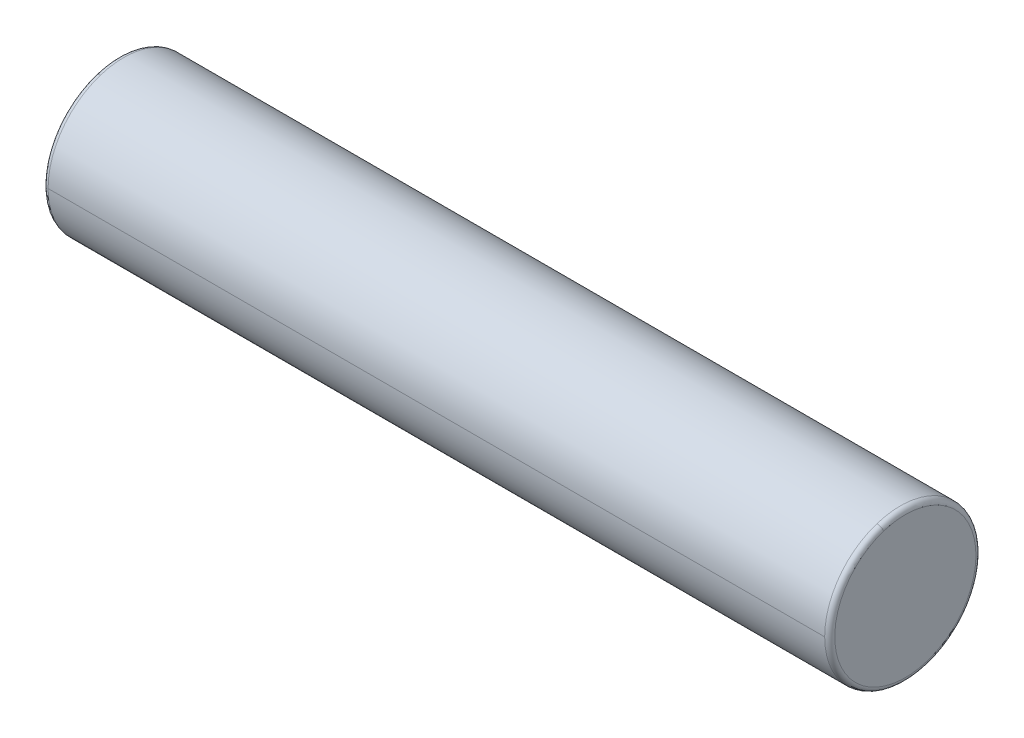
ISO-10303-21;
HEADER;
FILE_DESCRIPTION(('STEP AP214'),'2;1');
FILE_NAME('part.step','',(''),(''),'','','');
FILE_SCHEMA(('AUTOMOTIVE_DESIGN { 1 0 10303 214 1 1 1 1 }'));
ENDSEC;
DATA;
#1=APPLICATION_CONTEXT('core data for automotive mechanical design processes');
#2=APPLICATION_PROTOCOL_DEFINITION('international standard','automotive_design',2000,#1);
#3=PRODUCT_CONTEXT('',#1,'mechanical');
#4=PRODUCT('Part','Part','',(#3));
#5=PRODUCT_RELATED_PRODUCT_CATEGORY('part','',(#4));
#6=PRODUCT_DEFINITION_FORMATION('','',#4);
#7=PRODUCT_DEFINITION_CONTEXT('part definition',#1,'design');
#8=PRODUCT_DEFINITION('design','',#6,#7);
#9=PRODUCT_DEFINITION_SHAPE('','',#8);
#10=(LENGTH_UNIT() NAMED_UNIT(*) SI_UNIT(.MILLI.,.METRE.));
#11=(NAMED_UNIT(*) PLANE_ANGLE_UNIT() SI_UNIT($,.RADIAN.));
#12=(NAMED_UNIT(*) SI_UNIT($,.STERADIAN.) SOLID_ANGLE_UNIT());
#13=UNCERTAINTY_MEASURE_WITH_UNIT(LENGTH_MEASURE(1.E-05),#10,'distance_accuracy_value','');
#14=(GEOMETRIC_REPRESENTATION_CONTEXT(3) GLOBAL_UNCERTAINTY_ASSIGNED_CONTEXT((#13)) GLOBAL_UNIT_ASSIGNED_CONTEXT((#10,
#11,#12)) REPRESENTATION_CONTEXT('',''));
#15=CARTESIAN_POINT('',(0.,0.,0.));
#16=DIRECTION('',(0.,0.,1.));
#17=DIRECTION('',(1.,0.,0.));
#18=AXIS2_PLACEMENT_3D('',#15,#16,#17);
#19=CARTESIAN_POINT('',(2.1,3.75,0.));
#20=DIRECTION('',(1.,0.,0.));
#21=DIRECTION('',(0.,0.,-1.));
#22=AXIS2_PLACEMENT_3D('',#19,#20,#21);
#23=PLANE('',#22);
#24=CARTESIAN_POINT('',(2.1,4.41573956140652,0.216311896062434));
#25=CARTESIAN_POINT('',(2.1,4.41220039378035,0.227205120242794));
#26=CARTESIAN_POINT('',(2.1,4.40839342079428,0.238011307449353));
#27=CARTESIAN_POINT('',(2.1,4.40025403376515,0.259423954343163));
#28=CARTESIAN_POINT('',(2.1,4.39592161972208,0.270030414030415));
#29=CARTESIAN_POINT('',(2.1,4.38674152024174,0.291017952313907));
#30=CARTESIAN_POINT('',(2.1,4.38189383480447,0.301399030910147));
#31=CARTESIAN_POINT('',(2.1,4.37169494271154,0.321910825329425));
#32=CARTESIAN_POINT('',(2.1,4.36634373605587,0.332041541152462));
#33=CARTESIAN_POINT('',(2.1,4.35515067384588,0.352028196943182));
#34=CARTESIAN_POINT('',(2.1,4.34930881829157,0.361884136910865));
#35=CARTESIAN_POINT('',(2.1,4.3371485369722,0.381297499124348));
#36=CARTESIAN_POINT('',(2.1,4.33083011120713,0.390854921370148));
#37=CARTESIAN_POINT('',(2.1,4.31773190972843,0.409648222948401));
#38=CARTESIAN_POINT('',(2.1,4.3109521340148,0.418884102280853));
#39=CARTESIAN_POINT('',(2.1,4.29694756608198,0.437012068130574));
#40=CARTESIAN_POINT('',(2.1,4.28972277386278,0.445904154647843));
#41=CARTESIAN_POINT('',(2.1,4.27484557797712,0.463323113014291));
#42=CARTESIAN_POINT('',(2.1,4.26719317431064,0.47184998486347));
#43=CARTESIAN_POINT('',(2.1,4.25147919086763,0.48851797192267));
#44=CARTESIAN_POINT('',(2.1,4.2434176110911,0.496659087132692));
#45=CARTESIAN_POINT('',(2.1,4.22690469647266,0.512535948251258));
#46=CARTESIAN_POINT('',(2.1,4.21845336163076,0.520271694159802));
#47=CARTESIAN_POINT('',(2.1,4.20118129688937,0.535319180586672));
#48=CARTESIAN_POINT('',(2.1,4.19236056698989,0.542630921104998));
#49=CARTESIAN_POINT('',(2.1,4.17437096204376,0.556812782127896));
#50=CARTESIAN_POINT('',(2.1,4.16520208699712,0.563682902632468));
#51=CARTESIAN_POINT('',(2.1,4.14653828037989,0.576964972905863));
#52=CARTESIAN_POINT('',(2.1,4.13704334880931,0.583376922674686));
#53=CARTESIAN_POINT('',(2.1,4.11775030326599,0.595727204527956));
#54=CARTESIAN_POINT('',(2.1,4.10795218929324,0.601665536612403));
#55=CARTESIAN_POINT('',(2.1,4.08807638346038,0.613054277134795));
#56=CARTESIAN_POINT('',(2.1,4.07799869160026,0.618504685572741));
#57=CARTESIAN_POINT('',(2.1,4.05758800803502,0.628904448290805));
#58=CARTESIAN_POINT('',(2.1,4.04725501632991,0.633853802570923));
#59=CARTESIAN_POINT('',(2.1,4.02635862615678,0.643239533545359));
#60=CARTESIAN_POINT('',(2.1,4.01579522768877,0.647675910239676));
#61=CARTESIAN_POINT('',(2.1,3.99446347214198,0.656024998422473));
#62=CARTESIAN_POINT('',(2.1,3.9836951150632,0.659937709910952));
#63=CARTESIAN_POINT('',(2.1,3.96197938421031,0.667230041617384));
#64=CARTESIAN_POINT('',(2.1,3.95103201043618,0.670609661835336));
#65=CARTESIAN_POINT('',(2.1,3.92898461937487,0.676827669199589));
#66=CARTESIAN_POINT('',(2.1,3.91788460208769,0.679666056345889));
#67=CARTESIAN_POINT('',(2.1,3.89555866491416,0.68479475964359));
#68=CARTESIAN_POINT('',(2.1,3.88433274502782,0.68708507579499));
#69=CARTESIAN_POINT('',(2.1,3.86178204688025,0.691112119530673));
#70=CARTESIAN_POINT('',(2.1,3.85045726861902,0.692848847114956));
#71=CARTESIAN_POINT('',(2.1,3.82773613610444,0.695764529787534));
#72=CARTESIAN_POINT('',(2.1,3.81633978185109,0.69694348487583));
#73=CARTESIAN_POINT('',(2.1,3.79350295216788,0.698740782350362));
#74=CARTESIAN_POINT('',(2.1,3.78206247673801,0.699359124736598));
#75=CARTESIAN_POINT('',(2.1,3.75916496580913,0.700033707166043));
#76=CARTESIAN_POINT('',(2.1,3.74770793031013,0.700089947209252));
#77=CARTESIAN_POINT('',(2.1,3.724804900245,0.699640189465451));
#78=CARTESIAN_POINT('',(2.1,3.71335890567888,0.699134191678441));
#79=CARTESIAN_POINT('',(2.1,3.69050553188301,0.697561177267193));
#80=CARTESIAN_POINT('',(2.1,3.67909815265324,0.696494160642954));
#81=CARTESIAN_POINT('',(2.1,3.65634949090581,0.693801679093756));
#82=CARTESIAN_POINT('',(2.1,3.64500820838813,0.692176214168796));
#83=CARTESIAN_POINT('',(2.1,3.62241906220783,0.688370751905532));
#84=CARTESIAN_POINT('',(2.1,3.61117119854521,0.686190754567228));
#85=CARTESIAN_POINT('',(2.1,3.58879598716377,0.68128147928181));
#86=CARTESIAN_POINT('',(2.1,3.57766863944495,0.678552201334696));
#87=CARTESIAN_POINT('',(2.1,3.55556126670643,0.672550939901289));
#88=CARTESIAN_POINT('',(2.1,3.54458124168672,0.669278956414996));
#89=CARTESIAN_POINT('',(2.1,3.52279496618842,0.662200166398041));
#90=CARTESIAN_POINT('',(2.1,3.51198871570982,0.658393359867379));
#91=CARTESIAN_POINT('',(2.1,3.49057602249767,0.650254094692056));
#92=CARTESIAN_POINT('',(2.1,3.4799695797641,0.645921636047394));
#93=CARTESIAN_POINT('',(2.1,3.45898205389158,0.636741503916425));
#94=CARTESIAN_POINT('',(2.1,3.44860097075261,0.631893830430117));
#95=CARTESIAN_POINT('',(2.1,3.42808917300782,0.621694947085891));
#96=CARTESIAN_POINT('',(2.1,3.41795845840201,0.616343737227972));
#97=CARTESIAN_POINT('',(2.1,3.39797180350235,0.605150672673781));
#98=CARTESIAN_POINT('',(2.1,3.38811586320852,0.599308817977509));
#99=CARTESIAN_POINT('',(2.1,3.36870250075627,0.587148537286261));
#100=CARTESIAN_POINT('',(2.1,3.35914507859786,0.580830111291285));
#101=CARTESIAN_POINT('',(2.1,3.34035177708359,0.567731909644281));
#102=CARTESIAN_POINT('',(2.1,3.33111589772772,0.560952133992252));
#103=CARTESIAN_POINT('',(2.1,3.31298793186086,0.546947566104525));
#104=CARTESIAN_POINT('',(2.1,3.30409584534986,0.539722773868827));
#105=CARTESIAN_POINT('',(2.1,3.28667688698801,0.524845577971075));
#106=CARTESIAN_POINT('',(2.1,3.27815001513715,0.517193174309021));
#107=CARTESIAN_POINT('',(2.1,3.26148202807672,0.501479190869249));
#108=CARTESIAN_POINT('',(2.1,3.25334091286714,0.493417611091532));
#109=CARTESIAN_POINT('',(2.1,3.23746405174891,0.47690469647223));
#110=CARTESIAN_POINT('',(2.1,3.22972830584024,0.468453361630645));
#111=CARTESIAN_POINT('',(2.1,3.21468081941328,0.451181296889491));
#112=CARTESIAN_POINT('',(2.1,3.20736907889499,0.442360566989922));
#113=CARTESIAN_POINT('',(2.1,3.19318721787212,0.424370962043732));
#114=CARTESIAN_POINT('',(2.1,3.18631709736754,0.415202086997111));
#115=CARTESIAN_POINT('',(2.1,3.17303502709413,0.396538280379902));
#116=CARTESIAN_POINT('',(2.1,3.16662307732531,0.387043348809315));
#117=CARTESIAN_POINT('',(2.1,3.15427279547205,0.367750303265987));
#118=CARTESIAN_POINT('',(2.1,3.1483344633876,0.357952189293245));
#119=CARTESIAN_POINT('',(2.1,3.1369457228652,0.338076383460381));
#120=CARTESIAN_POINT('',(2.1,3.13149531442726,0.327998691600258));
#121=CARTESIAN_POINT('',(2.1,3.1210955517092,0.307588008035025));
#122=CARTESIAN_POINT('',(2.1,3.11614619742908,0.297255016329915));
#123=CARTESIAN_POINT('',(2.1,3.10676046645464,0.276358626156785));
#124=CARTESIAN_POINT('',(2.1,3.10232408976032,0.265795227688766));
#125=CARTESIAN_POINT('',(2.1,3.09397500157753,0.244463472141978));
#126=CARTESIAN_POINT('',(2.1,3.09006229008906,0.233695115063208));
#127=CARTESIAN_POINT('',(2.1,3.08276995838261,0.211979384210306));
#128=CARTESIAN_POINT('',(2.1,3.07939033816463,0.201032010436173));
#129=CARTESIAN_POINT('',(2.1,3.07317233080044,0.178984619374883));
#130=CARTESIAN_POINT('',(2.1,3.07033394365423,0.167884602087726));
#131=CARTESIAN_POINT('',(2.1,3.06520524035629,0.145558664914134));
#132=CARTESIAN_POINT('',(2.1,3.06291492420456,0.134332745027699));
#133=CARTESIAN_POINT('',(2.1,3.05888788046978,0.111782046880368));
#134=CARTESIAN_POINT('',(2.1,3.05715115288672,0.100457268619472));
#135=CARTESIAN_POINT('',(2.1,3.05423547021079,0.0777361361039879));
#136=CARTESIAN_POINT('',(2.1,3.05305651511793,0.0663397818494006));
#137=CARTESIAN_POINT('',(2.1,3.05125921765588,0.0435029521695724));
#138=CARTESIAN_POINT('',(2.1,3.05064087528668,0.0320624767443316));
#139=CARTESIAN_POINT('',(2.1,3.04996629281068,0.00916496580281616));
#140=CARTESIAN_POINT('',(2.1,3.04991005270386,-0.00229206971345843));
#141=CARTESIAN_POINT('',(2.1,3.05035981062143,-0.0251950997314124));
#142=CARTESIAN_POINT('',(2.1,3.05086580864581,-0.0366410942330917));
#143=CARTESIAN_POINT('',(2.1,3.05243882240855,-0.0594944682050133));
#144=CARTESIAN_POINT('',(2.1,3.05350583814691,-0.0709018476752554));
#145=CARTESIAN_POINT('',(2.1,3.05619832211637,-0.0936505087656896));
#146=CARTESIAN_POINT('',(2.1,3.05782379034747,-0.104991790385882));
#147=CARTESIAN_POINT('',(2.1,3.0616292435782,-0.127580939018153));
#148=CARTESIAN_POINT('',(2.1,3.06380922857782,-0.138828806030232));
#149=CARTESIAN_POINT('',(2.1,3.06871853757314,-0.161204008260792));
#150=CARTESIAN_POINT('',(2.1,3.07144786156883,-0.172331343479273));
#151=CARTESIAN_POINT('',(2.1,3.07744899719519,-0.194438750369344));
#152=CARTESIAN_POINT('',(2.1,3.08072080882586,-0.205418822040934));
#153=CARTESIAN_POINT('',(2.1,3.08426043859348,-0.216311896062432));
#154=B_SPLINE_CURVE_WITH_KNOTS('',3,(#24,#25,#26,#27,#28,#29,#30,#31,#32,#33,#34,#35,#36,#37,
#38,#39,#40,#41,#42,#43,#44,#45,#46,#47,#48,#49,#50,#51,#52,#53,#54,#55,#56,#57,#58,#59,#60,#61,
#62,#63,#64,#65,#66,#67,#68,#69,#70,#71,#72,#73,#74,#75,#76,#77,#78,#79,#80,#81,#82,#83,#84,#85,
#86,#87,#88,#89,#90,#91,#92,#93,#94,#95,#96,#97,#98,#99,#100,#101,#102,#103,#104,#105,#106,#107,
#108,#109,#110,#111,#112,#113,#114,#115,#116,#117,#118,#119,#120,#121,#122,#123,#124,#125,#126,
#127,#128,#129,#130,#131,#132,#133,#134,#135,#136,#137,#138,#139,#140,#141,#142,#143,#144,#145,
#146,#147,#148,#149,#150,#151,#152,#153),.UNSPECIFIED.,.F.,.F.,(4,2,2,2,2,2,2,2,2,2,2,2,2,2,2,2,
2,2,2,2,2,2,2,2,2,2,2,2,2,2,2,2,2,2,2,2,2,2,2,2,2,2,2,2,2,2,2,2,2,2,2,2,2,2,2,2,2,2,2,2,2,2,2,2,
4),(0.,0.0343577199320727,0.068715439864145,0.103073159796217,0.13743087972829,
0.171788599660363,0.206146319592435,0.240504039524508,0.27486175945658,0.309219479388653,
0.343577199320725,0.377934919252798,0.41229263918487,0.446650359116943,0.481008079049015,
0.515365798981088,0.549723518913161,0.584081238845233,0.618438958777306,0.652796678709378,
0.687154398641451,0.721512118573524,0.755869838505596,0.790227558437668,0.824585278369741,
0.858942998301814,0.893300718233886,0.927658438165958,0.962016158098031,0.996373878030104,
1.03073159796218,1.06508931789425,1.09944703782632,1.13380475775839,1.16816247769047,
1.20252019762254,1.23687791755461,1.27123563748668,1.30559335741876,1.33995107735083,
1.3743087972829,1.40866651721497,1.44302423714705,1.47738195707912,1.51173967701119,
1.54609739694326,1.58045511687534,1.61481283680741,1.64917055673948,1.68352827667155,
1.71788599660363,1.7522437165357,1.78660143646777,1.82095915639984,1.85531687633192,
1.88967459626399,1.92403231619606,1.95839003612813,1.99274775606021,2.02710547599228,
2.06146319592435,2.09582091585642,2.1301786357885,2.16453635572057,2.19889407565264),.UNSPECIFIED.);
#155=CARTESIAN_POINT('',(2.1,4.41573956140652,0.216311896062434));
#156=VERTEX_POINT('',#155);
#157=CARTESIAN_POINT('',(2.1,3.08426043859348,-0.216311896062434));
#158=VERTEX_POINT('',#157);
#159=EDGE_CURVE('E11',#156,#158,#154,.T.);
#160=ORIENTED_EDGE('',*,*,#159,.F.);
#161=CARTESIAN_POINT('',(2.1,3.08426043859348,-0.216311896062434));
#162=CARTESIAN_POINT('',(2.1,3.08779960621965,-0.227205120242794));
#163=CARTESIAN_POINT('',(2.1,3.09160657920571,-0.238011307449352));
#164=CARTESIAN_POINT('',(2.1,3.09974596623485,-0.259423954343163));
#165=CARTESIAN_POINT('',(2.1,3.10407838027792,-0.270030414030415));
#166=CARTESIAN_POINT('',(2.1,3.11325847975826,-0.291017952313907));
#167=CARTESIAN_POINT('',(2.1,3.11810616519553,-0.301399030910147));
#168=CARTESIAN_POINT('',(2.1,3.12830505728846,-0.321910825329424));
#169=CARTESIAN_POINT('',(2.1,3.13365626394413,-0.332041541152462));
#170=CARTESIAN_POINT('',(2.1,3.14484932615411,-0.352028196943182));
#171=CARTESIAN_POINT('',(2.1,3.15069118170843,-0.361884136910865));
#172=CARTESIAN_POINT('',(2.1,3.1628514630278,-0.381297499124348));
#173=CARTESIAN_POINT('',(2.1,3.16916988879287,-0.390854921370148));
#174=CARTESIAN_POINT('',(2.1,3.18226809027157,-0.409648222948401));
#175=CARTESIAN_POINT('',(2.1,3.1890478659852,-0.418884102280853));
#176=CARTESIAN_POINT('',(2.1,3.20305243391802,-0.437012068130574));
#177=CARTESIAN_POINT('',(2.1,3.21027722613721,-0.445904154647843));
#178=CARTESIAN_POINT('',(2.1,3.22515442202288,-0.463323113014291));
#179=CARTESIAN_POINT('',(2.1,3.23280682568936,-0.47184998486347));
#180=CARTESIAN_POINT('',(2.1,3.24852080913237,-0.48851797192267));
#181=CARTESIAN_POINT('',(2.1,3.2565823889089,-0.496659087132692));
#182=CARTESIAN_POINT('',(2.1,3.27309530352734,-0.512535948251258));
#183=CARTESIAN_POINT('',(2.1,3.28154663836924,-0.520271694159802));
#184=CARTESIAN_POINT('',(2.1,3.29881870311063,-0.535319180586672));
#185=CARTESIAN_POINT('',(2.1,3.30763943301011,-0.542630921104998));
#186=CARTESIAN_POINT('',(2.1,3.32562903795624,-0.556812782127896));
#187=CARTESIAN_POINT('',(2.1,3.33479791300288,-0.563682902632468));
#188=CARTESIAN_POINT('',(2.1,3.35346171962011,-0.576964972905863));
#189=CARTESIAN_POINT('',(2.1,3.36295665119069,-0.583376922674686));
#190=CARTESIAN_POINT('',(2.1,3.38224969673401,-0.595727204527956));
#191=CARTESIAN_POINT('',(2.1,3.39204781070675,-0.601665536612402));
#192=CARTESIAN_POINT('',(2.1,3.41192361653962,-0.613054277134795));
#193=CARTESIAN_POINT('',(2.1,3.42200130839974,-0.618504685572741));
#194=CARTESIAN_POINT('',(2.1,3.44241199196498,-0.628904448290805));
#195=CARTESIAN_POINT('',(2.1,3.45274498367009,-0.633853802570923));
#196=CARTESIAN_POINT('',(2.1,3.47364137384322,-0.643239533545359));
#197=CARTESIAN_POINT('',(2.1,3.48420477231123,-0.647675910239676));
#198=CARTESIAN_POINT('',(2.1,3.50553652785802,-0.656024998422473));
#199=CARTESIAN_POINT('',(2.1,3.51630488493679,-0.659937709910952));
#200=CARTESIAN_POINT('',(2.1,3.53802061578969,-0.667230041617384));
#201=CARTESIAN_POINT('',(2.1,3.54896798956382,-0.670609661835336));
#202=CARTESIAN_POINT('',(2.1,3.57101538062513,-0.676827669199589));
#203=CARTESIAN_POINT('',(2.1,3.58211539791231,-0.679666056345889));
#204=CARTESIAN_POINT('',(2.1,3.60444133508583,-0.68479475964359));
#205=CARTESIAN_POINT('',(2.1,3.61566725497218,-0.68708507579499));
#206=CARTESIAN_POINT('',(2.1,3.63821795311975,-0.691112119530673));
#207=CARTESIAN_POINT('',(2.1,3.64954273138098,-0.692848847114955));
#208=CARTESIAN_POINT('',(2.1,3.67226386389556,-0.695764529787534));
#209=CARTESIAN_POINT('',(2.1,3.68366021814891,-0.69694348487583));
#210=CARTESIAN_POINT('',(2.1,3.70649704783212,-0.698740782350362));
#211=CARTESIAN_POINT('',(2.1,3.71793752326199,-0.699359124736598));
#212=CARTESIAN_POINT('',(2.1,3.74083503419086,-0.700033707166044));
#213=CARTESIAN_POINT('',(2.1,3.75229206968987,-0.700089947209252));
#214=CARTESIAN_POINT('',(2.1,3.775195099755,-0.699640189465451));
#215=CARTESIAN_POINT('',(2.1,3.78664109432111,-0.699134191678441));
#216=CARTESIAN_POINT('',(2.1,3.80949446811699,-0.697561177267193));
#217=CARTESIAN_POINT('',(2.1,3.82090184734675,-0.696494160642955));
#218=CARTESIAN_POINT('',(2.1,3.84365050909419,-0.693801679093756));
#219=CARTESIAN_POINT('',(2.1,3.85499179161187,-0.692176214168796));
#220=CARTESIAN_POINT('',(2.1,3.87758093779217,-0.688370751905532));
#221=CARTESIAN_POINT('',(2.1,3.88882880145479,-0.686190754567228));
#222=CARTESIAN_POINT('',(2.1,3.91120401283623,-0.68128147928181));
#223=CARTESIAN_POINT('',(2.1,3.92233136055505,-0.678552201334696));
#224=CARTESIAN_POINT('',(2.1,3.94443873329357,-0.672550939901289));
#225=CARTESIAN_POINT('',(2.1,3.95541875831328,-0.669278956414996));
#226=CARTESIAN_POINT('',(2.1,3.97720503381158,-0.662200166398041));
#227=CARTESIAN_POINT('',(2.1,3.98801128429018,-0.658393359867379));
#228=CARTESIAN_POINT('',(2.1,4.00942397750233,-0.650254094692056));
#229=CARTESIAN_POINT('',(2.1,4.02003042023589,-0.645921636047394));
#230=CARTESIAN_POINT('',(2.1,4.04101794610842,-0.636741503916425));
#231=CARTESIAN_POINT('',(2.1,4.05139902924739,-0.631893830430118));
#232=CARTESIAN_POINT('',(2.1,4.07191082699218,-0.621694947085891));
#233=CARTESIAN_POINT('',(2.1,4.08204154159799,-0.616343737227972));
#234=CARTESIAN_POINT('',(2.1,4.10202819649765,-0.605150672673781));
#235=CARTESIAN_POINT('',(2.1,4.11188413679148,-0.59930881797751));
#236=CARTESIAN_POINT('',(2.1,4.13129749924373,-0.587148537286262));
#237=CARTESIAN_POINT('',(2.1,4.14085492140213,-0.580830111291286));
#238=CARTESIAN_POINT('',(2.1,4.15964822291641,-0.567731909644281));
#239=CARTESIAN_POINT('',(2.1,4.16888410227228,-0.560952133992253));
#240=CARTESIAN_POINT('',(2.1,4.18701206813914,-0.546947566104526));
#241=CARTESIAN_POINT('',(2.1,4.19590415465014,-0.539722773868827));
#242=CARTESIAN_POINT('',(2.1,4.21332311301199,-0.524845577971075));
#243=CARTESIAN_POINT('',(2.1,4.22184998486285,-0.517193174309022));
#244=CARTESIAN_POINT('',(2.1,4.23851797192328,-0.50147919086925));
#245=CARTESIAN_POINT('',(2.1,4.24665908713286,-0.493417611091533));
#246=CARTESIAN_POINT('',(2.1,4.26253594825109,-0.476904696472231));
#247=CARTESIAN_POINT('',(2.1,4.27027169415976,-0.468453361630646));
#248=CARTESIAN_POINT('',(2.1,4.28531918058671,-0.451181296889492));
#249=CARTESIAN_POINT('',(2.1,4.29263092110501,-0.442360566989923));
#250=CARTESIAN_POINT('',(2.1,4.30681278212788,-0.424370962043732));
#251=CARTESIAN_POINT('',(2.1,4.31368290263246,-0.415202086997111));
#252=CARTESIAN_POINT('',(2.1,4.32696497290586,-0.396538280379903));
#253=CARTESIAN_POINT('',(2.1,4.33337692267469,-0.387043348809316));
#254=CARTESIAN_POINT('',(2.1,4.34572720452795,-0.367750303265988));
#255=CARTESIAN_POINT('',(2.1,4.3516655366124,-0.357952189293246));
#256=CARTESIAN_POINT('',(2.1,4.36305427713479,-0.338076383460382));
#257=CARTESIAN_POINT('',(2.1,4.36850468557274,-0.327998691600259));
#258=CARTESIAN_POINT('',(2.1,4.3789044482908,-0.307588008035026));
#259=CARTESIAN_POINT('',(2.1,4.38385380257092,-0.297255016329915));
#260=CARTESIAN_POINT('',(2.1,4.39323953354536,-0.276358626156786));
#261=CARTESIAN_POINT('',(2.1,4.39767591023968,-0.265795227688767));
#262=CARTESIAN_POINT('',(2.1,4.40602499842247,-0.244463472141979));
#263=CARTESIAN_POINT('',(2.1,4.40993770991094,-0.233695115063209));
#264=CARTESIAN_POINT('',(2.1,4.41723004161739,-0.211979384210307));
#265=CARTESIAN_POINT('',(2.1,4.42060966183537,-0.201032010436174));
#266=CARTESIAN_POINT('',(2.1,4.42682766919956,-0.178984619374885));
#267=CARTESIAN_POINT('',(2.1,4.42966605634577,-0.167884602087727));
#268=CARTESIAN_POINT('',(2.1,4.43479475964371,-0.145558664914135));
#269=CARTESIAN_POINT('',(2.1,4.43708507579544,-0.134332745027701));
#270=CARTESIAN_POINT('',(2.1,4.44111211953022,-0.111782046880369));
#271=CARTESIAN_POINT('',(2.1,4.44284884711328,-0.100457268619473));
#272=CARTESIAN_POINT('',(2.1,4.4457645297892,-0.0777361361039889));
#273=CARTESIAN_POINT('',(2.1,4.44694348488207,-0.0663397818494017));
#274=CARTESIAN_POINT('',(2.1,4.44874078234412,-0.0435029521695737));
#275=CARTESIAN_POINT('',(2.1,4.44935912471332,-0.0320624767443329));
#276=CARTESIAN_POINT('',(2.1,4.45003370718932,-0.00916496580281751));
#277=CARTESIAN_POINT('',(2.1,4.45008994729614,0.00229206971345709));
#278=CARTESIAN_POINT('',(2.1,4.44964018937857,0.025195099731411));
#279=CARTESIAN_POINT('',(2.1,4.44913419135419,0.0366410942330904));
#280=CARTESIAN_POINT('',(2.1,4.44756117759145,0.0594944682050119));
#281=CARTESIAN_POINT('',(2.1,4.44649416185309,0.0709018476752541));
#282=CARTESIAN_POINT('',(2.1,4.44380167788363,0.0936505087656885));
#283=CARTESIAN_POINT('',(2.1,4.44217620965253,0.104991790385881));
#284=CARTESIAN_POINT('',(2.1,4.4383707564218,0.127580939018152));
#285=CARTESIAN_POINT('',(2.1,4.43619077142218,0.138828806030232));
#286=CARTESIAN_POINT('',(2.1,4.43128146242686,0.161204008260792));
#287=CARTESIAN_POINT('',(2.1,4.42855213843117,0.172331343479273));
#288=CARTESIAN_POINT('',(2.1,4.42255100280481,0.194438750369343));
#289=CARTESIAN_POINT('',(2.1,4.41927919117414,0.205418822040933));
#290=CARTESIAN_POINT('',(2.1,4.41573956140652,0.21631189606243));
#291=B_SPLINE_CURVE_WITH_KNOTS('',3,(#161,#162,#163,#164,#165,#166,#167,#168,#169,#170,#171,
#172,#173,#174,#175,#176,#177,#178,#179,#180,#181,#182,#183,#184,#185,#186,#187,#188,#189,#190,
#191,#192,#193,#194,#195,#196,#197,#198,#199,#200,#201,#202,#203,#204,#205,#206,#207,#208,#209,
#210,#211,#212,#213,#214,#215,#216,#217,#218,#219,#220,#221,#222,#223,#224,#225,#226,#227,#228,
#229,#230,#231,#232,#233,#234,#235,#236,#237,#238,#239,#240,#241,#242,#243,#244,#245,#246,#247,
#248,#249,#250,#251,#252,#253,#254,#255,#256,#257,#258,#259,#260,#261,#262,#263,#264,#265,#266,
#267,#268,#269,#270,#271,#272,#273,#274,#275,#276,#277,#278,#279,#280,#281,#282,#283,#284,#285,
#286,#287,#288,#289,#290),.UNSPECIFIED.,.F.,.F.,(4,2,2,2,2,2,2,2,2,2,2,2,2,2,2,2,2,2,2,2,2,2,2,
2,2,2,2,2,2,2,2,2,2,2,2,2,2,2,2,2,2,2,2,2,2,2,2,2,2,2,2,2,2,2,2,2,2,2,2,2,2,2,2,2,4),(0.,
0.0343577199320726,0.0687154398641448,0.103073159796217,0.13743087972829,0.171788599660363,
0.206146319592435,0.240504039524507,0.27486175945658,0.309219479388653,0.343577199320725,
0.377934919252798,0.41229263918487,0.446650359116943,0.481008079049015,0.515365798981088,
0.54972351891316,0.584081238845233,0.618438958777305,0.652796678709378,0.687154398641451,
0.721512118573523,0.755869838505595,0.790227558437668,0.82458527836974,0.858942998301813,
0.893300718233886,0.927658438165958,0.962016158098031,0.996373878030102,1.03073159796218,
1.06508931789425,1.09944703782632,1.13380475775839,1.16816247769047,1.20252019762254,
1.23687791755461,1.27123563748668,1.30559335741876,1.33995107735083,1.3743087972829,
1.40866651721497,1.44302423714705,1.47738195707912,1.51173967701119,1.54609739694326,
1.58045511687534,1.61481283680741,1.64917055673948,1.68352827667155,1.71788599660363,
1.7522437165357,1.78660143646777,1.82095915639984,1.85531687633192,1.88967459626399,
1.92403231619606,1.95839003612813,1.9927477560602,2.02710547599228,2.06146319592435,
2.09582091585642,2.1301786357885,2.16453635572057,2.19889407565264),.UNSPECIFIED.);
#292=EDGE_CURVE('E26',#158,#156,#291,.T.);
#293=ORIENTED_EDGE('',*,*,#292,.F.);
#294=EDGE_LOOP('',(#160,#293));
#295=FACE_BOUND('',#294,.T.);
#296=ADVANCED_FACE('F17',(#295),#23,.F.);
#297=CARTESIAN_POINT('',(2.15000000000009,3.75,0.));
#298=DIRECTION('',(1.,0.,0.));
#299=DIRECTION('',(0.,-0.309016994374947,0.951056516295154));
#300=AXIS2_PLACEMENT_3D('',#297,#298,#299);
#301=TOROIDAL_SURFACE('',#300,0.699999999999906,0.0500000000000947);
#302=CARTESIAN_POINT('',(2.15000000000009,3.08426043859348,-0.216311896062434));
#303=DIRECTION('',(0.,0.309016994374946,-0.951056516295154));
#304=DIRECTION('',(-1.90070181815466E-12,-0.951056516295154,-0.309016994374946));
#305=AXIS2_PLACEMENT_3D('',#302,#303,#304);
#306=CIRCLE('',#305,0.050000000000095);
#307=CARTESIAN_POINT('',(2.15,3.03670761277863,-0.231762745781211));
#308=VERTEX_POINT('',#307);
#309=EDGE_CURVE('E139',#308,#158,#306,.T.);
#310=ORIENTED_EDGE('',*,*,#309,.T.);
#311=ORIENTED_EDGE('',*,*,#292,.T.);
#312=CARTESIAN_POINT('',(2.15000000000009,4.41573956140652,0.216311896062434));
#313=DIRECTION('',(0.,-0.309016994374946,0.951056516295154));
#314=DIRECTION('',(-1.90070181815466E-12,0.951056516295154,0.309016994374946));
#315=AXIS2_PLACEMENT_3D('',#312,#313,#314);
#316=CIRCLE('',#315,0.050000000000095);
#317=CARTESIAN_POINT('',(2.15,4.46329238722137,0.231762745781211));
#318=VERTEX_POINT('',#317);
#319=EDGE_CURVE('E135',#318,#156,#316,.T.);
#320=ORIENTED_EDGE('',*,*,#319,.F.);
#321=CARTESIAN_POINT('',(2.15,3.75,0.));
#322=DIRECTION('',(1.,0.,0.));
#323=DIRECTION('',(0.,0.,-1.));
#324=AXIS2_PLACEMENT_3D('',#321,#322,#323);
#325=CIRCLE('',#324,0.75);
#326=CARTESIAN_POINT('',(2.15,3.75,-0.75));
#327=VERTEX_POINT('',#326);
#328=EDGE_CURVE('E130',#327,#318,#325,.T.);
#329=ORIENTED_EDGE('',*,*,#328,.F.);
#330=CARTESIAN_POINT('',(2.15,3.75,0.));
#331=DIRECTION('',(1.,0.,0.));
#332=DIRECTION('',(0.,0.,-1.));
#333=AXIS2_PLACEMENT_3D('',#330,#331,#332);
#334=CIRCLE('',#333,0.75);
#335=EDGE_CURVE('E125',#308,#327,#334,.T.);
#336=ORIENTED_EDGE('',*,*,#335,.F.);
#337=EDGE_LOOP('',(#310,#311,#320,#329,#336));
#338=FACE_BOUND('',#337,.T.);
#339=ADVANCED_FACE('F146',(#338),#301,.T.);
#340=CARTESIAN_POINT('',(9.9,3.75,0.));
#341=DIRECTION('',(1.,0.,0.));
#342=DIRECTION('',(0.,1.,0.));
#343=AXIS2_PLACEMENT_3D('',#340,#341,#342);
#344=CYLINDRICAL_SURFACE('',#343,0.75);
#345=DIRECTION('',(1.,0.,0.));
#346=VECTOR('',#345,1.);
#347=CARTESIAN_POINT('',(2.15,3.75,0.75));
#348=LINE('',#347,#346);
#349=CARTESIAN_POINT('',(2.15,3.75,0.75));
#350=VERTEX_POINT('',#349);
#351=CARTESIAN_POINT('',(9.85,3.75,0.75));
#352=VERTEX_POINT('',#351);
#353=EDGE_CURVE('E92',#350,#352,#348,.T.);
#354=ORIENTED_EDGE('',*,*,#353,.F.);
#355=CARTESIAN_POINT('',(2.15,3.75,0.));
#356=DIRECTION('',(1.,0.,0.));
#357=DIRECTION('',(0.,0.,-1.));
#358=AXIS2_PLACEMENT_3D('',#355,#356,#357);
#359=CIRCLE('',#358,0.75);
#360=EDGE_CURVE('E117',#350,#308,#359,.T.);
#361=ORIENTED_EDGE('',*,*,#360,.T.);
#362=ORIENTED_EDGE('',*,*,#335,.T.);
#363=DIRECTION('',(1.,0.,0.));
#364=VECTOR('',#363,1.);
#365=CARTESIAN_POINT('',(2.15,3.75,-0.75));
#366=LINE('',#365,#364);
#367=CARTESIAN_POINT('',(9.85,3.75,-0.75));
#368=VERTEX_POINT('',#367);
#369=EDGE_CURVE('E113',#327,#368,#366,.T.);
#370=ORIENTED_EDGE('',*,*,#369,.T.);
#371=CARTESIAN_POINT('',(9.85,3.75,0.));
#372=DIRECTION('',(1.,0.,0.));
#373=DIRECTION('',(0.,0.,-1.));
#374=AXIS2_PLACEMENT_3D('',#371,#372,#373);
#375=CIRCLE('',#374,0.75);
#376=CARTESIAN_POINT('',(9.85,3.03670761277863,-0.231762745781211));
#377=VERTEX_POINT('',#376);
#378=EDGE_CURVE('E84',#377,#368,#375,.T.);
#379=ORIENTED_EDGE('',*,*,#378,.F.);
#380=CARTESIAN_POINT('',(9.85,3.75,0.));
#381=DIRECTION('',(1.,0.,0.));
#382=DIRECTION('',(0.,0.,-1.));
#383=AXIS2_PLACEMENT_3D('',#380,#381,#382);
#384=CIRCLE('',#383,0.75);
#385=EDGE_CURVE('E106',#352,#377,#384,.T.);
#386=ORIENTED_EDGE('',*,*,#385,.F.);
#387=EDGE_LOOP('',(#354,#361,#362,#370,#379,#386));
#388=FACE_BOUND('',#387,.T.);
#389=ADVANCED_FACE('F155',(#388),#344,.T.);
#390=CARTESIAN_POINT('',(9.85,3.75,0.));
#391=DIRECTION('',(1.,0.,0.));
#392=DIRECTION('',(0.,0.309016994374947,-0.951056516295154));
#393=AXIS2_PLACEMENT_3D('',#390,#391,#392);
#394=TOROIDAL_SURFACE('',#393,0.699999999999904,0.0500000000000968);
#395=CARTESIAN_POINT('',(9.85,3.08426043859348,-0.216311896062433));
#396=DIRECTION('',(0.,0.309016994374947,-0.951056516295154));
#397=DIRECTION('',(1.,0.,0.));
#398=AXIS2_PLACEMENT_3D('',#395,#396,#397);
#399=CIRCLE('',#398,0.0500000000000966);
#400=CARTESIAN_POINT('',(9.9000000000001,3.08426043859348,-0.216311896062433));
#401=VERTEX_POINT('',#400);
#402=EDGE_CURVE('E102',#401,#377,#399,.T.);
#403=ORIENTED_EDGE('',*,*,#402,.F.);
#404=CARTESIAN_POINT('',(9.9,3.75,0.));
#405=DIRECTION('',(1.,0.,0.));
#406=DIRECTION('',(0.,0.,-1.));
#407=AXIS2_PLACEMENT_3D('',#404,#405,#406);
#408=CIRCLE('',#407,0.7);
#409=CARTESIAN_POINT('',(9.9000000000001,4.41573956140652,0.216311896062434));
#410=VERTEX_POINT('',#409);
#411=EDGE_CURVE('E74',#410,#401,#408,.T.);
#412=ORIENTED_EDGE('',*,*,#411,.F.);
#413=CARTESIAN_POINT('',(9.85,4.41573956140652,0.216311896062433));
#414=DIRECTION('',(0.,-0.309016994374947,0.951056516295154));
#415=DIRECTION('',(1.,0.,0.));
#416=AXIS2_PLACEMENT_3D('',#413,#414,#415);
#417=CIRCLE('',#416,0.0500000000000966);
#418=CARTESIAN_POINT('',(9.85,4.46329238722137,0.231762745781211));
#419=VERTEX_POINT('',#418);
#420=EDGE_CURVE('E67',#410,#419,#417,.T.);
#421=ORIENTED_EDGE('',*,*,#420,.T.);
#422=CARTESIAN_POINT('',(9.85,3.75,0.));
#423=DIRECTION('',(1.,0.,0.));
#424=DIRECTION('',(0.,0.,-1.));
#425=AXIS2_PLACEMENT_3D('',#422,#423,#424);
#426=CIRCLE('',#425,0.75);
#427=EDGE_CURVE('E72',#419,#352,#426,.T.);
#428=ORIENTED_EDGE('',*,*,#427,.T.);
#429=ORIENTED_EDGE('',*,*,#385,.T.);
#430=EDGE_LOOP('',(#403,#412,#421,#428,#429));
#431=FACE_BOUND('',#430,.T.);
#432=ADVANCED_FACE('F69',(#431),#394,.T.);
#433=CARTESIAN_POINT('',(9.9,3.75,0.));
#434=DIRECTION('',(1.,0.,0.));
#435=DIRECTION('',(0.,-1.,0.));
#436=AXIS2_PLACEMENT_3D('',#433,#434,#435);
#437=CYLINDRICAL_SURFACE('',#436,0.75);
#438=ORIENTED_EDGE('',*,*,#353,.T.);
#439=ORIENTED_EDGE('',*,*,#427,.F.);
#440=CARTESIAN_POINT('',(9.85,3.75,0.));
#441=DIRECTION('',(1.,0.,0.));
#442=DIRECTION('',(0.,0.,-1.));
#443=AXIS2_PLACEMENT_3D('',#440,#441,#442);
#444=CIRCLE('',#443,0.75);
#445=EDGE_CURVE('E81',#368,#419,#444,.T.);
#446=ORIENTED_EDGE('',*,*,#445,.F.);
#447=ORIENTED_EDGE('',*,*,#369,.F.);
#448=ORIENTED_EDGE('',*,*,#328,.T.);
#449=CARTESIAN_POINT('',(2.15,3.75,0.));
#450=DIRECTION('',(1.,0.,0.));
#451=DIRECTION('',(0.,0.,-1.));
#452=AXIS2_PLACEMENT_3D('',#449,#450,#451);
#453=CIRCLE('',#452,0.75);
#454=EDGE_CURVE('E87',#318,#350,#453,.T.);
#455=ORIENTED_EDGE('',*,*,#454,.T.);
#456=EDGE_LOOP('',(#438,#439,#446,#447,#448,#455));
#457=FACE_BOUND('',#456,.T.);
#458=ADVANCED_FACE('F90',(#457),#437,.T.);
#459=CARTESIAN_POINT('',(2.15000000000009,3.75,0.));
#460=DIRECTION('',(1.,0.,0.));
#461=DIRECTION('',(0.,0.309016994374947,-0.951056516295154));
#462=AXIS2_PLACEMENT_3D('',#459,#460,#461);
#463=TOROIDAL_SURFACE('',#462,0.699999999999906,0.0500000000000947);
#464=ORIENTED_EDGE('',*,*,#309,.F.);
#465=ORIENTED_EDGE('',*,*,#360,.F.);
#466=ORIENTED_EDGE('',*,*,#454,.F.);
#467=ORIENTED_EDGE('',*,*,#319,.T.);
#468=ORIENTED_EDGE('',*,*,#159,.T.);
#469=EDGE_LOOP('',(#464,#465,#466,#467,#468));
#470=FACE_BOUND('',#469,.T.);
#471=ADVANCED_FACE('F164',(#470),#463,.T.);
#472=CARTESIAN_POINT('',(9.85,3.75,0.));
#473=DIRECTION('',(1.,0.,0.));
#474=DIRECTION('',(0.,-0.309016994374947,0.951056516295154));
#475=AXIS2_PLACEMENT_3D('',#472,#473,#474);
#476=TOROIDAL_SURFACE('',#475,0.699999999999904,0.0500000000000968);
#477=ORIENTED_EDGE('',*,*,#402,.T.);
#478=ORIENTED_EDGE('',*,*,#378,.T.);
#479=ORIENTED_EDGE('',*,*,#445,.T.);
#480=ORIENTED_EDGE('',*,*,#420,.F.);
#481=CARTESIAN_POINT('',(9.9,3.08426043859339,-0.216311896062463));
#482=CARTESIAN_POINT('',(9.9,3.15228052141772,-0.425367142842009));
#483=CARTESIAN_POINT('',(9.9,3.30202972657809,-0.608308772771781));
#484=CARTESIAN_POINT('',(9.9,3.52130566124638,-0.719750933121307));
#485=CARTESIAN_POINT('',(9.9,3.992932666311,-0.747669867747458));
#486=CARTESIAN_POINT('',(9.9,4.35807659038147,-0.447867577010209));
#487=CARTESIAN_POINT('',(9.9,4.4699704896485,-0.228821814816915));
#488=CARTESIAN_POINT('',(9.9,4.48358974941431,0.00720144711070897));
#489=CARTESIAN_POINT('',(9.9,4.41573956140661,0.216311896062463));
#490=B_SPLINE_CURVE_WITH_KNOTS('',5,(#481,#482,#483,#484,#485,#486,#487,#488,#489),
.UNSPECIFIED.,.F.,.F.,(6,3,6),(0.,1.5707963267949,3.14159265358979),.UNSPECIFIED.);
#491=EDGE_CURVE('E185',#401,#410,#490,.T.);
#492=ORIENTED_EDGE('',*,*,#491,.F.);
#493=EDGE_LOOP('',(#477,#478,#479,#480,#492));
#494=FACE_BOUND('',#493,.T.);
#495=ADVANCED_FACE('F83',(#494),#476,.T.);
#496=CARTESIAN_POINT('',(9.9,4.45,0.));
#497=DIRECTION('',(-1.,0.,0.));
#498=DIRECTION('',(0.,0.,1.));
#499=AXIS2_PLACEMENT_3D('',#496,#497,#498);
#500=PLANE('',#499);
#501=ORIENTED_EDGE('',*,*,#491,.T.);
#502=ORIENTED_EDGE('',*,*,#411,.T.);
#503=EDGE_LOOP('',(#501,#502));
#504=FACE_BOUND('',#503,.T.);
#505=ADVANCED_FACE('F191',(#504),#500,.F.);
#506=CLOSED_SHELL('',(#296,#339,#389,#432,#458,#471,#495,#505));
#507=MANIFOLD_SOLID_BREP('B1',#506);
#508=ADVANCED_BREP_SHAPE_REPRESENTATION('',(#18,#507),#14);
#509=SHAPE_DEFINITION_REPRESENTATION(#9,#508);
ENDSEC;
END-ISO-10303-21;
